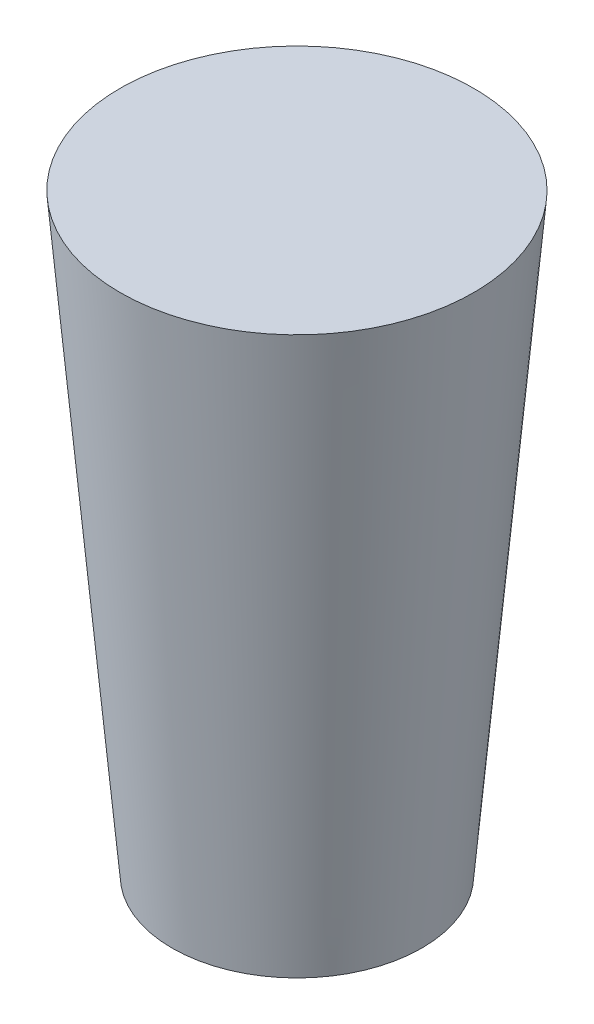
ISO-10303-21;
HEADER;
FILE_DESCRIPTION(('STEP AP214'),'2;1');
FILE_NAME('part.step','',(''),(''),'','','');
FILE_SCHEMA(('AUTOMOTIVE_DESIGN { 1 0 10303 214 1 1 1 1 }'));
ENDSEC;
DATA;
#1=APPLICATION_CONTEXT('core data for automotive mechanical design processes');
#2=APPLICATION_PROTOCOL_DEFINITION('international standard','automotive_design',2000,#1);
#3=PRODUCT_CONTEXT('',#1,'mechanical');
#4=PRODUCT('Part','Part','',(#3));
#5=PRODUCT_RELATED_PRODUCT_CATEGORY('part','',(#4));
#6=PRODUCT_DEFINITION_FORMATION('','',#4);
#7=PRODUCT_DEFINITION_CONTEXT('part definition',#1,'design');
#8=PRODUCT_DEFINITION('design','',#6,#7);
#9=PRODUCT_DEFINITION_SHAPE('','',#8);
#10=(LENGTH_UNIT() NAMED_UNIT(*) SI_UNIT(.MILLI.,.METRE.));
#11=(NAMED_UNIT(*) PLANE_ANGLE_UNIT() SI_UNIT($,.RADIAN.));
#12=(NAMED_UNIT(*) SI_UNIT($,.STERADIAN.) SOLID_ANGLE_UNIT());
#13=UNCERTAINTY_MEASURE_WITH_UNIT(LENGTH_MEASURE(1.E-05),#10,'distance_accuracy_value','');
#14=(GEOMETRIC_REPRESENTATION_CONTEXT(3) GLOBAL_UNCERTAINTY_ASSIGNED_CONTEXT((#13)) GLOBAL_UNIT_ASSIGNED_CONTEXT((#10,
#11,#12)) REPRESENTATION_CONTEXT('',''));
#15=CARTESIAN_POINT('',(0.,0.,0.));
#16=DIRECTION('',(0.,0.,1.));
#17=DIRECTION('',(1.,0.,0.));
#18=AXIS2_PLACEMENT_3D('',#15,#16,#17);
#19=CARTESIAN_POINT('',(0.,0.,0.));
#20=DIRECTION('',(0.,1.,0.));
#21=DIRECTION('',(0.,0.,1.));
#22=AXIS2_PLACEMENT_3D('',#19,#20,#21);
#23=CONICAL_SURFACE('',#22,10.5219966868913,0.0872664625997165);
#24=CARTESIAN_POINT('',(0.,50.,0.));
#25=DIRECTION('',(0.,1.,0.));
#26=DIRECTION('',(0.,0.,1.));
#27=AXIS2_PLACEMENT_3D('',#24,#25,#26);
#28=CIRCLE('',#27,14.8964298631875);
#29=CARTESIAN_POINT('',(0.,50.,14.8964298631875));
#30=VERTEX_POINT('',#29);
#31=EDGE_CURVE('E10',#30,#30,#28,.T.);
#32=ORIENTED_EDGE('',*,*,#31,.F.);
#33=EDGE_LOOP('',(#32));
#34=FACE_BOUND('',#33,.T.);
#35=CARTESIAN_POINT('',(0.,0.,0.));
#36=DIRECTION('',(0.,1.,0.));
#37=DIRECTION('',(0.,0.,1.));
#38=AXIS2_PLACEMENT_3D('',#35,#36,#37);
#39=CIRCLE('',#38,10.5219966868913);
#40=CARTESIAN_POINT('',(0.,0.,10.5219966868913));
#41=VERTEX_POINT('',#40);
#42=EDGE_CURVE('E39',#41,#41,#39,.T.);
#43=ORIENTED_EDGE('',*,*,#42,.T.);
#44=EDGE_LOOP('',(#43));
#45=FACE_BOUND('',#44,.T.);
#46=ADVANCED_FACE('F33',(#34,#45),#23,.T.);
#47=CARTESIAN_POINT('',(0.,50.,0.));
#48=DIRECTION('',(0.,1.,0.));
#49=DIRECTION('',(0.,0.,1.));
#50=AXIS2_PLACEMENT_3D('',#47,#48,#49);
#51=PLANE('',#50);
#52=ORIENTED_EDGE('',*,*,#31,.T.);
#53=EDGE_LOOP('',(#52));
#54=FACE_BOUND('',#53,.T.);
#55=ADVANCED_FACE('F48',(#54),#51,.T.);
#56=CARTESIAN_POINT('',(0.,0.,0.));
#57=DIRECTION('',(0.,1.,0.));
#58=DIRECTION('',(0.,0.,1.));
#59=AXIS2_PLACEMENT_3D('',#56,#57,#58);
#60=PLANE('',#59);
#61=ORIENTED_EDGE('',*,*,#42,.F.);
#62=EDGE_LOOP('',(#61));
#63=FACE_BOUND('',#62,.T.);
#64=ADVANCED_FACE('F46',(#63),#60,.F.);
#65=CLOSED_SHELL('',(#46,#55,#64));
#66=MANIFOLD_SOLID_BREP('B2',#65);
#67=ADVANCED_BREP_SHAPE_REPRESENTATION('',(#18,#66),#14);
#68=SHAPE_DEFINITION_REPRESENTATION(#9,#67);
ENDSEC;
END-ISO-10303-21;
